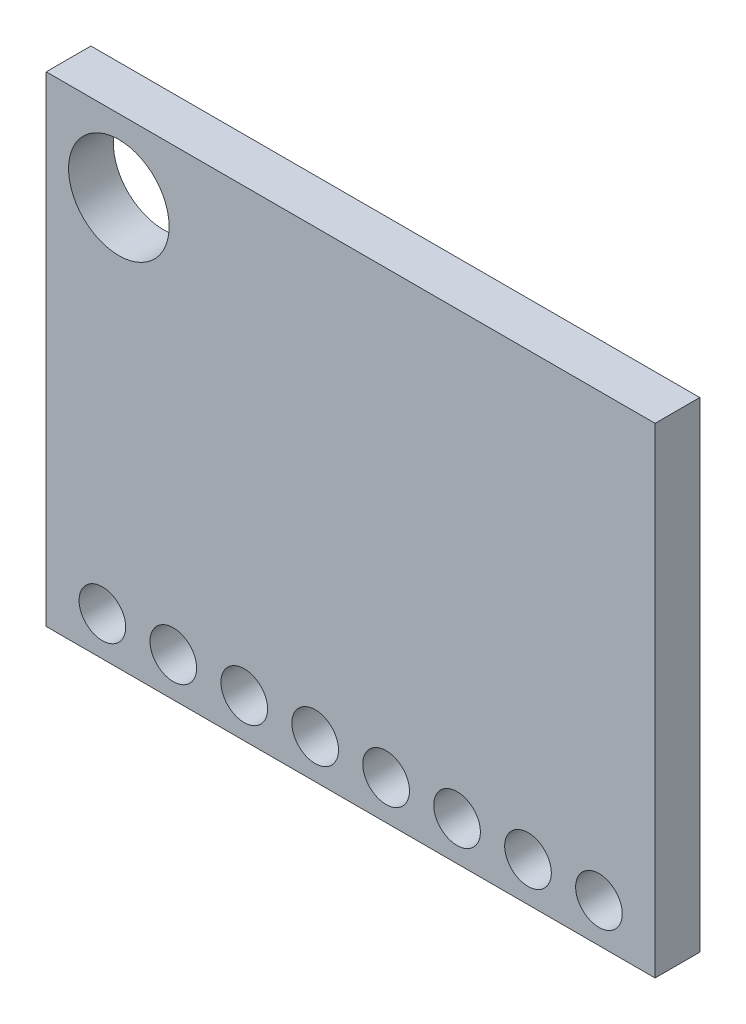
ISO-10303-21;
HEADER;
FILE_DESCRIPTION(('STEP AP214'),'2;1');
FILE_NAME('part.step','',(''),(''),'','','');
FILE_SCHEMA(('AUTOMOTIVE_DESIGN { 1 0 10303 214 1 1 1 1 }'));
ENDSEC;
DATA;
#1=APPLICATION_CONTEXT('core data for automotive mechanical design processes');
#2=APPLICATION_PROTOCOL_DEFINITION('international standard','automotive_design',2000,#1);
#3=PRODUCT_CONTEXT('',#1,'mechanical');
#4=PRODUCT('Part','Part','',(#3));
#5=PRODUCT_RELATED_PRODUCT_CATEGORY('part','',(#4));
#6=PRODUCT_DEFINITION_FORMATION('','',#4);
#7=PRODUCT_DEFINITION_CONTEXT('part definition',#1,'design');
#8=PRODUCT_DEFINITION('design','',#6,#7);
#9=PRODUCT_DEFINITION_SHAPE('','',#8);
#10=(LENGTH_UNIT() NAMED_UNIT(*) SI_UNIT(.MILLI.,.METRE.));
#11=(NAMED_UNIT(*) PLANE_ANGLE_UNIT() SI_UNIT($,.RADIAN.));
#12=(NAMED_UNIT(*) SI_UNIT($,.STERADIAN.) SOLID_ANGLE_UNIT());
#13=UNCERTAINTY_MEASURE_WITH_UNIT(LENGTH_MEASURE(1.E-05),#10,'distance_accuracy_value','');
#14=(GEOMETRIC_REPRESENTATION_CONTEXT(3) GLOBAL_UNCERTAINTY_ASSIGNED_CONTEXT((#13)) GLOBAL_UNIT_ASSIGNED_CONTEXT((#10,
#11,#12)) REPRESENTATION_CONTEXT('',''));
#15=CARTESIAN_POINT('',(0.,0.,0.));
#16=DIRECTION('',(0.,0.,1.));
#17=DIRECTION('',(1.,0.,0.));
#18=AXIS2_PLACEMENT_3D('',#15,#16,#17);
#19=CARTESIAN_POINT('',(-10.9,-8.6,1.6));
#20=DIRECTION('',(1.,0.,0.));
#21=DIRECTION('',(0.,0.,-1.));
#22=AXIS2_PLACEMENT_3D('',#19,#20,#21);
#23=PLANE('',#22);
#24=DIRECTION('',(0.,-1.,0.));
#25=VECTOR('',#24,1.);
#26=CARTESIAN_POINT('',(-10.9,-8.6,0.));
#27=LINE('',#26,#25);
#28=CARTESIAN_POINT('',(-10.9,8.6,0.));
#29=VERTEX_POINT('',#28);
#30=CARTESIAN_POINT('',(-10.9,-8.6,0.));
#31=VERTEX_POINT('',#30);
#32=EDGE_CURVE('E95',#29,#31,#27,.T.);
#33=ORIENTED_EDGE('',*,*,#32,.T.);
#34=DIRECTION('',(0.,0.,-1.));
#35=VECTOR('',#34,1.);
#36=CARTESIAN_POINT('',(-10.9,-8.6,1.6));
#37=LINE('',#36,#35);
#38=CARTESIAN_POINT('',(-10.9,-8.6,1.6));
#39=VERTEX_POINT('',#38);
#40=EDGE_CURVE('E11',#39,#31,#37,.T.);
#41=ORIENTED_EDGE('',*,*,#40,.F.);
#42=DIRECTION('',(0.,-1.,0.));
#43=VECTOR('',#42,1.);
#44=CARTESIAN_POINT('',(-10.9,-8.6,1.6));
#45=LINE('',#44,#43);
#46=CARTESIAN_POINT('',(-10.9,8.6,1.6));
#47=VERTEX_POINT('',#46);
#48=EDGE_CURVE('E83',#47,#39,#45,.T.);
#49=ORIENTED_EDGE('',*,*,#48,.F.);
#50=DIRECTION('',(0.,0.,-1.));
#51=VECTOR('',#50,1.);
#52=CARTESIAN_POINT('',(-10.9,8.6,1.6));
#53=LINE('',#52,#51);
#54=EDGE_CURVE('E91',#47,#29,#53,.T.);
#55=ORIENTED_EDGE('',*,*,#54,.T.);
#56=EDGE_LOOP('',(#33,#41,#49,#55));
#57=FACE_BOUND('',#56,.T.);
#58=ADVANCED_FACE('F32',(#57),#23,.F.);
#59=CARTESIAN_POINT('',(10.9,-8.6,1.6));
#60=DIRECTION('',(0.,1.,0.));
#61=DIRECTION('',(-1.,0.,0.));
#62=AXIS2_PLACEMENT_3D('',#59,#60,#61);
#63=PLANE('',#62);
#64=DIRECTION('',(1.,0.,0.));
#65=VECTOR('',#64,1.);
#66=CARTESIAN_POINT('',(10.9,-8.6,0.));
#67=LINE('',#66,#65);
#68=CARTESIAN_POINT('',(10.9,-8.6,0.));
#69=VERTEX_POINT('',#68);
#70=EDGE_CURVE('E87',#31,#69,#67,.T.);
#71=ORIENTED_EDGE('',*,*,#70,.T.);
#72=DIRECTION('',(0.,0.,-1.));
#73=VECTOR('',#72,1.);
#74=CARTESIAN_POINT('',(10.9,-8.6,1.6));
#75=LINE('',#74,#73);
#76=CARTESIAN_POINT('',(10.9,-8.6,1.6));
#77=VERTEX_POINT('',#76);
#78=EDGE_CURVE('E40',#77,#69,#75,.T.);
#79=ORIENTED_EDGE('',*,*,#78,.F.);
#80=DIRECTION('',(1.,0.,0.));
#81=VECTOR('',#80,1.);
#82=CARTESIAN_POINT('',(10.9,-8.6,1.6));
#83=LINE('',#82,#81);
#84=EDGE_CURVE('E78',#39,#77,#83,.T.);
#85=ORIENTED_EDGE('',*,*,#84,.F.);
#86=ORIENTED_EDGE('',*,*,#40,.T.);
#87=EDGE_LOOP('',(#71,#79,#85,#86));
#88=FACE_BOUND('',#87,.T.);
#89=ADVANCED_FACE('F86',(#88),#63,.F.);
#90=CARTESIAN_POINT('',(10.9,-8.6,1.6));
#91=DIRECTION('',(-1.,0.,0.));
#92=DIRECTION('',(0.,0.,1.));
#93=AXIS2_PLACEMENT_3D('',#90,#91,#92);
#94=PLANE('',#93);
#95=DIRECTION('',(0.,1.,0.));
#96=VECTOR('',#95,1.);
#97=CARTESIAN_POINT('',(10.9,-8.6,0.));
#98=LINE('',#97,#96);
#99=CARTESIAN_POINT('',(10.9,8.6,0.));
#100=VERTEX_POINT('',#99);
#101=EDGE_CURVE('E65',#69,#100,#98,.T.);
#102=ORIENTED_EDGE('',*,*,#101,.T.);
#103=DIRECTION('',(0.,0.,-1.));
#104=VECTOR('',#103,1.);
#105=CARTESIAN_POINT('',(10.9,8.6,1.6));
#106=LINE('',#105,#104);
#107=CARTESIAN_POINT('',(10.9,8.6,1.6));
#108=VERTEX_POINT('',#107);
#109=EDGE_CURVE('E88',#108,#100,#106,.T.);
#110=ORIENTED_EDGE('',*,*,#109,.F.);
#111=DIRECTION('',(0.,1.,0.));
#112=VECTOR('',#111,1.);
#113=CARTESIAN_POINT('',(10.9,-8.6,1.6));
#114=LINE('',#113,#112);
#115=EDGE_CURVE('E81',#77,#108,#114,.T.);
#116=ORIENTED_EDGE('',*,*,#115,.F.);
#117=ORIENTED_EDGE('',*,*,#78,.T.);
#118=EDGE_LOOP('',(#102,#110,#116,#117));
#119=FACE_BOUND('',#118,.T.);
#120=ADVANCED_FACE('F89',(#119),#94,.F.);
#121=CARTESIAN_POINT('',(10.9,8.6,1.6));
#122=DIRECTION('',(0.,-1.,0.));
#123=DIRECTION('',(1.,0.,0.));
#124=AXIS2_PLACEMENT_3D('',#121,#122,#123);
#125=PLANE('',#124);
#126=DIRECTION('',(-1.,0.,0.));
#127=VECTOR('',#126,1.);
#128=CARTESIAN_POINT('',(10.9,8.6,0.));
#129=LINE('',#128,#127);
#130=EDGE_CURVE('E71',#100,#29,#129,.T.);
#131=ORIENTED_EDGE('',*,*,#130,.T.);
#132=ORIENTED_EDGE('',*,*,#54,.F.);
#133=DIRECTION('',(-1.,0.,0.));
#134=VECTOR('',#133,1.);
#135=CARTESIAN_POINT('',(10.9,8.6,1.6));
#136=LINE('',#135,#134);
#137=EDGE_CURVE('E48',#108,#47,#136,.T.);
#138=ORIENTED_EDGE('',*,*,#137,.F.);
#139=ORIENTED_EDGE('',*,*,#109,.T.);
#140=EDGE_LOOP('',(#131,#132,#138,#139));
#141=FACE_BOUND('',#140,.T.);
#142=ADVANCED_FACE('F103',(#141),#125,.F.);
#143=CARTESIAN_POINT('',(0.,0.,1.6));
#144=DIRECTION('',(0.,0.,1.));
#145=DIRECTION('',(1.,0.,0.));
#146=AXIS2_PLACEMENT_3D('',#143,#144,#145);
#147=PLANE('',#146);
#148=CARTESIAN_POINT('',(8.89,-7.2,1.6));
#149=DIRECTION('',(0.,0.,1.));
#150=DIRECTION('',(1.,0.,0.));
#151=AXIS2_PLACEMENT_3D('',#148,#149,#150);
#152=CIRCLE('',#151,0.835000000000001);
#153=CARTESIAN_POINT('',(9.725,-7.2,1.6));
#154=VERTEX_POINT('',#153);
#155=EDGE_CURVE('E157',#154,#154,#152,.T.);
#156=ORIENTED_EDGE('',*,*,#155,.F.);
#157=EDGE_LOOP('',(#156));
#158=FACE_BOUND('',#157,.T.);
#159=CARTESIAN_POINT('',(6.35,-7.2,1.6));
#160=DIRECTION('',(0.,0.,1.));
#161=DIRECTION('',(1.,0.,0.));
#162=AXIS2_PLACEMENT_3D('',#159,#160,#161);
#163=CIRCLE('',#162,0.835000000000001);
#164=CARTESIAN_POINT('',(7.185,-7.2,1.6));
#165=VERTEX_POINT('',#164);
#166=EDGE_CURVE('E151',#165,#165,#163,.T.);
#167=ORIENTED_EDGE('',*,*,#166,.F.);
#168=EDGE_LOOP('',(#167));
#169=FACE_BOUND('',#168,.T.);
#170=CARTESIAN_POINT('',(3.81,-7.2,1.6));
#171=DIRECTION('',(0.,0.,1.));
#172=DIRECTION('',(1.,0.,0.));
#173=AXIS2_PLACEMENT_3D('',#170,#171,#172);
#174=CIRCLE('',#173,0.835000000000001);
#175=CARTESIAN_POINT('',(4.645,-7.2,1.6));
#176=VERTEX_POINT('',#175);
#177=EDGE_CURVE('E145',#176,#176,#174,.T.);
#178=ORIENTED_EDGE('',*,*,#177,.F.);
#179=EDGE_LOOP('',(#178));
#180=FACE_BOUND('',#179,.T.);
#181=CARTESIAN_POINT('',(1.27,-7.2,1.6));
#182=DIRECTION('',(0.,0.,1.));
#183=DIRECTION('',(1.,0.,0.));
#184=AXIS2_PLACEMENT_3D('',#181,#182,#183);
#185=CIRCLE('',#184,0.835000000000001);
#186=CARTESIAN_POINT('',(2.105,-7.2,1.6));
#187=VERTEX_POINT('',#186);
#188=EDGE_CURVE('E139',#187,#187,#185,.T.);
#189=ORIENTED_EDGE('',*,*,#188,.F.);
#190=EDGE_LOOP('',(#189));
#191=FACE_BOUND('',#190,.T.);
#192=CARTESIAN_POINT('',(-1.27,-7.2,1.6));
#193=DIRECTION('',(0.,0.,1.));
#194=DIRECTION('',(1.,0.,0.));
#195=AXIS2_PLACEMENT_3D('',#192,#193,#194);
#196=CIRCLE('',#195,0.835000000000001);
#197=CARTESIAN_POINT('',(-0.434999999999999,-7.2,1.6));
#198=VERTEX_POINT('',#197);
#199=EDGE_CURVE('E122',#198,#198,#196,.T.);
#200=ORIENTED_EDGE('',*,*,#199,.F.);
#201=EDGE_LOOP('',(#200));
#202=FACE_BOUND('',#201,.T.);
#203=CARTESIAN_POINT('',(-8.3,6.,1.6));
#204=DIRECTION('',(0.,0.,1.));
#205=DIRECTION('',(1.,0.,0.));
#206=AXIS2_PLACEMENT_3D('',#203,#204,#205);
#207=CIRCLE('',#206,1.8);
#208=CARTESIAN_POINT('',(-6.5,6.,1.6));
#209=VERTEX_POINT('',#208);
#210=EDGE_CURVE('E123',#209,#209,#207,.T.);
#211=ORIENTED_EDGE('',*,*,#210,.F.);
#212=EDGE_LOOP('',(#211));
#213=FACE_BOUND('',#212,.T.);
#214=CARTESIAN_POINT('',(-8.89,-7.2,1.6));
#215=DIRECTION('',(0.,0.,1.));
#216=DIRECTION('',(1.,0.,0.));
#217=AXIS2_PLACEMENT_3D('',#214,#215,#216);
#218=CIRCLE('',#217,0.835000000000001);
#219=CARTESIAN_POINT('',(-8.055,-7.2,1.6));
#220=VERTEX_POINT('',#219);
#221=EDGE_CURVE('E129',#220,#220,#218,.T.);
#222=ORIENTED_EDGE('',*,*,#221,.F.);
#223=EDGE_LOOP('',(#222));
#224=FACE_BOUND('',#223,.T.);
#225=CARTESIAN_POINT('',(-6.35,-7.2,1.6));
#226=DIRECTION('',(0.,0.,1.));
#227=DIRECTION('',(1.,0.,0.));
#228=AXIS2_PLACEMENT_3D('',#225,#226,#227);
#229=CIRCLE('',#228,0.835000000000001);
#230=CARTESIAN_POINT('',(-5.515,-7.2,1.6));
#231=VERTEX_POINT('',#230);
#232=EDGE_CURVE('E109',#231,#231,#229,.T.);
#233=ORIENTED_EDGE('',*,*,#232,.F.);
#234=EDGE_LOOP('',(#233));
#235=FACE_BOUND('',#234,.T.);
#236=CARTESIAN_POINT('',(-3.81,-7.2,1.6));
#237=DIRECTION('',(0.,0.,1.));
#238=DIRECTION('',(1.,0.,0.));
#239=AXIS2_PLACEMENT_3D('',#236,#237,#238);
#240=CIRCLE('',#239,0.835000000000001);
#241=CARTESIAN_POINT('',(-2.975,-7.2,1.6));
#242=VERTEX_POINT('',#241);
#243=EDGE_CURVE('E116',#242,#242,#240,.T.);
#244=ORIENTED_EDGE('',*,*,#243,.F.);
#245=EDGE_LOOP('',(#244));
#246=FACE_BOUND('',#245,.T.);
#247=ORIENTED_EDGE('',*,*,#48,.T.);
#248=ORIENTED_EDGE('',*,*,#84,.T.);
#249=ORIENTED_EDGE('',*,*,#115,.T.);
#250=ORIENTED_EDGE('',*,*,#137,.T.);
#251=EDGE_LOOP('',(#247,#248,#249,#250));
#252=FACE_BOUND('',#251,.T.);
#253=ADVANCED_FACE('F79',(#158,#169,#180,#191,#202,#213,#224,#235,#246,#252),#147,.T.);
#254=CARTESIAN_POINT('',(0.,0.,0.));
#255=DIRECTION('',(0.,0.,1.));
#256=DIRECTION('',(1.,0.,0.));
#257=AXIS2_PLACEMENT_3D('',#254,#255,#256);
#258=PLANE('',#257);
#259=CARTESIAN_POINT('',(8.89,-7.2,0.));
#260=DIRECTION('',(0.,0.,1.));
#261=DIRECTION('',(1.,0.,0.));
#262=AXIS2_PLACEMENT_3D('',#259,#260,#261);
#263=CIRCLE('',#262,0.835000000000001);
#264=CARTESIAN_POINT('',(9.725,-7.2,0.));
#265=VERTEX_POINT('',#264);
#266=EDGE_CURVE('E98',#265,#265,#263,.T.);
#267=ORIENTED_EDGE('',*,*,#266,.T.);
#268=EDGE_LOOP('',(#267));
#269=FACE_BOUND('',#268,.T.);
#270=CARTESIAN_POINT('',(6.35,-7.2,0.));
#271=DIRECTION('',(0.,0.,1.));
#272=DIRECTION('',(1.,0.,0.));
#273=AXIS2_PLACEMENT_3D('',#270,#271,#272);
#274=CIRCLE('',#273,0.835000000000001);
#275=CARTESIAN_POINT('',(7.185,-7.2,0.));
#276=VERTEX_POINT('',#275);
#277=EDGE_CURVE('E154',#276,#276,#274,.T.);
#278=ORIENTED_EDGE('',*,*,#277,.T.);
#279=EDGE_LOOP('',(#278));
#280=FACE_BOUND('',#279,.T.);
#281=CARTESIAN_POINT('',(3.81,-7.2,0.));
#282=DIRECTION('',(0.,0.,1.));
#283=DIRECTION('',(1.,0.,0.));
#284=AXIS2_PLACEMENT_3D('',#281,#282,#283);
#285=CIRCLE('',#284,0.835000000000001);
#286=CARTESIAN_POINT('',(4.645,-7.2,0.));
#287=VERTEX_POINT('',#286);
#288=EDGE_CURVE('E148',#287,#287,#285,.T.);
#289=ORIENTED_EDGE('',*,*,#288,.T.);
#290=EDGE_LOOP('',(#289));
#291=FACE_BOUND('',#290,.T.);
#292=CARTESIAN_POINT('',(1.27,-7.2,0.));
#293=DIRECTION('',(0.,0.,1.));
#294=DIRECTION('',(1.,0.,0.));
#295=AXIS2_PLACEMENT_3D('',#292,#293,#294);
#296=CIRCLE('',#295,0.835000000000001);
#297=CARTESIAN_POINT('',(2.105,-7.2,0.));
#298=VERTEX_POINT('',#297);
#299=EDGE_CURVE('E142',#298,#298,#296,.T.);
#300=ORIENTED_EDGE('',*,*,#299,.T.);
#301=EDGE_LOOP('',(#300));
#302=FACE_BOUND('',#301,.T.);
#303=CARTESIAN_POINT('',(-1.27,-7.2,0.));
#304=DIRECTION('',(0.,0.,1.));
#305=DIRECTION('',(1.,0.,0.));
#306=AXIS2_PLACEMENT_3D('',#303,#304,#305);
#307=CIRCLE('',#306,0.835000000000001);
#308=CARTESIAN_POINT('',(-0.434999999999999,-7.2,0.));
#309=VERTEX_POINT('',#308);
#310=EDGE_CURVE('E136',#309,#309,#307,.T.);
#311=ORIENTED_EDGE('',*,*,#310,.T.);
#312=EDGE_LOOP('',(#311));
#313=FACE_BOUND('',#312,.T.);
#314=CARTESIAN_POINT('',(-8.3,6.,0.));
#315=DIRECTION('',(0.,0.,1.));
#316=DIRECTION('',(1.,0.,0.));
#317=AXIS2_PLACEMENT_3D('',#314,#315,#316);
#318=CIRCLE('',#317,1.8);
#319=CARTESIAN_POINT('',(-6.5,6.,0.));
#320=VERTEX_POINT('',#319);
#321=EDGE_CURVE('E126',#320,#320,#318,.T.);
#322=ORIENTED_EDGE('',*,*,#321,.T.);
#323=EDGE_LOOP('',(#322));
#324=FACE_BOUND('',#323,.T.);
#325=CARTESIAN_POINT('',(-8.89,-7.2,0.));
#326=DIRECTION('',(0.,0.,1.));
#327=DIRECTION('',(1.,0.,0.));
#328=AXIS2_PLACEMENT_3D('',#325,#326,#327);
#329=CIRCLE('',#328,0.835000000000001);
#330=CARTESIAN_POINT('',(-8.055,-7.2,0.));
#331=VERTEX_POINT('',#330);
#332=EDGE_CURVE('E113',#331,#331,#329,.T.);
#333=ORIENTED_EDGE('',*,*,#332,.T.);
#334=EDGE_LOOP('',(#333));
#335=FACE_BOUND('',#334,.T.);
#336=CARTESIAN_POINT('',(-6.35,-7.2,0.));
#337=DIRECTION('',(0.,0.,1.));
#338=DIRECTION('',(1.,0.,0.));
#339=AXIS2_PLACEMENT_3D('',#336,#337,#338);
#340=CIRCLE('',#339,0.835000000000001);
#341=CARTESIAN_POINT('',(-5.515,-7.2,0.));
#342=VERTEX_POINT('',#341);
#343=EDGE_CURVE('E112',#342,#342,#340,.T.);
#344=ORIENTED_EDGE('',*,*,#343,.T.);
#345=EDGE_LOOP('',(#344));
#346=FACE_BOUND('',#345,.T.);
#347=CARTESIAN_POINT('',(-3.81,-7.2,0.));
#348=DIRECTION('',(0.,0.,1.));
#349=DIRECTION('',(1.,0.,0.));
#350=AXIS2_PLACEMENT_3D('',#347,#348,#349);
#351=CIRCLE('',#350,0.835000000000001);
#352=CARTESIAN_POINT('',(-2.975,-7.2,0.));
#353=VERTEX_POINT('',#352);
#354=EDGE_CURVE('E119',#353,#353,#351,.T.);
#355=ORIENTED_EDGE('',*,*,#354,.T.);
#356=EDGE_LOOP('',(#355));
#357=FACE_BOUND('',#356,.T.);
#358=ORIENTED_EDGE('',*,*,#32,.F.);
#359=ORIENTED_EDGE('',*,*,#130,.F.);
#360=ORIENTED_EDGE('',*,*,#101,.F.);
#361=ORIENTED_EDGE('',*,*,#70,.F.);
#362=EDGE_LOOP('',(#358,#359,#360,#361));
#363=FACE_BOUND('',#362,.T.);
#364=ADVANCED_FACE('F106',(#269,#280,#291,#302,#313,#324,#335,#346,#357,#363),#258,.F.);
#365=CARTESIAN_POINT('',(-3.81,-7.2,0.));
#366=DIRECTION('',(0.,0.,1.));
#367=DIRECTION('',(1.,0.,0.));
#368=AXIS2_PLACEMENT_3D('',#365,#366,#367);
#369=CYLINDRICAL_SURFACE('',#368,0.835000000000001);
#370=ORIENTED_EDGE('',*,*,#354,.F.);
#371=EDGE_LOOP('',(#370));
#372=FACE_BOUND('',#371,.T.);
#373=ORIENTED_EDGE('',*,*,#243,.T.);
#374=EDGE_LOOP('',(#373));
#375=FACE_BOUND('',#374,.T.);
#376=ADVANCED_FACE('F191',(#372,#375),#369,.F.);
#377=CARTESIAN_POINT('',(-6.35,-7.2,0.));
#378=DIRECTION('',(0.,0.,1.));
#379=DIRECTION('',(1.,0.,0.));
#380=AXIS2_PLACEMENT_3D('',#377,#378,#379);
#381=CYLINDRICAL_SURFACE('',#380,0.835000000000001);
#382=ORIENTED_EDGE('',*,*,#343,.F.);
#383=EDGE_LOOP('',(#382));
#384=FACE_BOUND('',#383,.T.);
#385=ORIENTED_EDGE('',*,*,#232,.T.);
#386=EDGE_LOOP('',(#385));
#387=FACE_BOUND('',#386,.T.);
#388=ADVANCED_FACE('F193',(#384,#387),#381,.F.);
#389=CARTESIAN_POINT('',(-8.89,-7.2,0.));
#390=DIRECTION('',(0.,0.,1.));
#391=DIRECTION('',(1.,0.,0.));
#392=AXIS2_PLACEMENT_3D('',#389,#390,#391);
#393=CYLINDRICAL_SURFACE('',#392,0.835000000000001);
#394=ORIENTED_EDGE('',*,*,#332,.F.);
#395=EDGE_LOOP('',(#394));
#396=FACE_BOUND('',#395,.T.);
#397=ORIENTED_EDGE('',*,*,#221,.T.);
#398=EDGE_LOOP('',(#397));
#399=FACE_BOUND('',#398,.T.);
#400=ADVANCED_FACE('F200',(#396,#399),#393,.F.);
#401=CARTESIAN_POINT('',(-8.3,6.,0.));
#402=DIRECTION('',(0.,0.,1.));
#403=DIRECTION('',(1.,0.,0.));
#404=AXIS2_PLACEMENT_3D('',#401,#402,#403);
#405=CYLINDRICAL_SURFACE('',#404,1.8);
#406=ORIENTED_EDGE('',*,*,#321,.F.);
#407=EDGE_LOOP('',(#406));
#408=FACE_BOUND('',#407,.T.);
#409=ORIENTED_EDGE('',*,*,#210,.T.);
#410=EDGE_LOOP('',(#409));
#411=FACE_BOUND('',#410,.T.);
#412=ADVANCED_FACE('F247',(#408,#411),#405,.F.);
#413=CARTESIAN_POINT('',(-1.27,-7.2,0.));
#414=DIRECTION('',(0.,0.,1.));
#415=DIRECTION('',(1.,0.,0.));
#416=AXIS2_PLACEMENT_3D('',#413,#414,#415);
#417=CYLINDRICAL_SURFACE('',#416,0.835000000000001);
#418=ORIENTED_EDGE('',*,*,#310,.F.);
#419=EDGE_LOOP('',(#418));
#420=FACE_BOUND('',#419,.T.);
#421=ORIENTED_EDGE('',*,*,#199,.T.);
#422=EDGE_LOOP('',(#421));
#423=FACE_BOUND('',#422,.T.);
#424=ADVANCED_FACE('F257',(#420,#423),#417,.F.);
#425=CARTESIAN_POINT('',(1.27,-7.2,0.));
#426=DIRECTION('',(0.,0.,1.));
#427=DIRECTION('',(1.,0.,0.));
#428=AXIS2_PLACEMENT_3D('',#425,#426,#427);
#429=CYLINDRICAL_SURFACE('',#428,0.835000000000001);
#430=ORIENTED_EDGE('',*,*,#299,.F.);
#431=EDGE_LOOP('',(#430));
#432=FACE_BOUND('',#431,.T.);
#433=ORIENTED_EDGE('',*,*,#188,.T.);
#434=EDGE_LOOP('',(#433));
#435=FACE_BOUND('',#434,.T.);
#436=ADVANCED_FACE('F266',(#432,#435),#429,.F.);
#437=CARTESIAN_POINT('',(3.81,-7.2,0.));
#438=DIRECTION('',(0.,0.,1.));
#439=DIRECTION('',(1.,0.,0.));
#440=AXIS2_PLACEMENT_3D('',#437,#438,#439);
#441=CYLINDRICAL_SURFACE('',#440,0.835000000000001);
#442=ORIENTED_EDGE('',*,*,#288,.F.);
#443=EDGE_LOOP('',(#442));
#444=FACE_BOUND('',#443,.T.);
#445=ORIENTED_EDGE('',*,*,#177,.T.);
#446=EDGE_LOOP('',(#445));
#447=FACE_BOUND('',#446,.T.);
#448=ADVANCED_FACE('F276',(#444,#447),#441,.F.);
#449=CARTESIAN_POINT('',(6.35,-7.2,0.));
#450=DIRECTION('',(0.,0.,1.));
#451=DIRECTION('',(1.,0.,0.));
#452=AXIS2_PLACEMENT_3D('',#449,#450,#451);
#453=CYLINDRICAL_SURFACE('',#452,0.835000000000001);
#454=ORIENTED_EDGE('',*,*,#277,.F.);
#455=EDGE_LOOP('',(#454));
#456=FACE_BOUND('',#455,.T.);
#457=ORIENTED_EDGE('',*,*,#166,.T.);
#458=EDGE_LOOP('',(#457));
#459=FACE_BOUND('',#458,.T.);
#460=ADVANCED_FACE('F168',(#456,#459),#453,.F.);
#461=CARTESIAN_POINT('',(8.89,-7.2,0.));
#462=DIRECTION('',(0.,0.,1.));
#463=DIRECTION('',(1.,0.,0.));
#464=AXIS2_PLACEMENT_3D('',#461,#462,#463);
#465=CYLINDRICAL_SURFACE('',#464,0.835000000000001);
#466=ORIENTED_EDGE('',*,*,#266,.F.);
#467=EDGE_LOOP('',(#466));
#468=FACE_BOUND('',#467,.T.);
#469=ORIENTED_EDGE('',*,*,#155,.T.);
#470=EDGE_LOOP('',(#469));
#471=FACE_BOUND('',#470,.T.);
#472=ADVANCED_FACE('F165',(#468,#471),#465,.F.);
#473=CLOSED_SHELL('',(#58,#89,#120,#142,#253,#364,#376,#388,#400,#412,#424,#436,#448,#460,#472));
#474=MANIFOLD_SOLID_BREP('B2',#473);
#475=ADVANCED_BREP_SHAPE_REPRESENTATION('',(#18,#474),#14);
#476=SHAPE_DEFINITION_REPRESENTATION(#9,#475);
ENDSEC;
END-ISO-10303-21;
